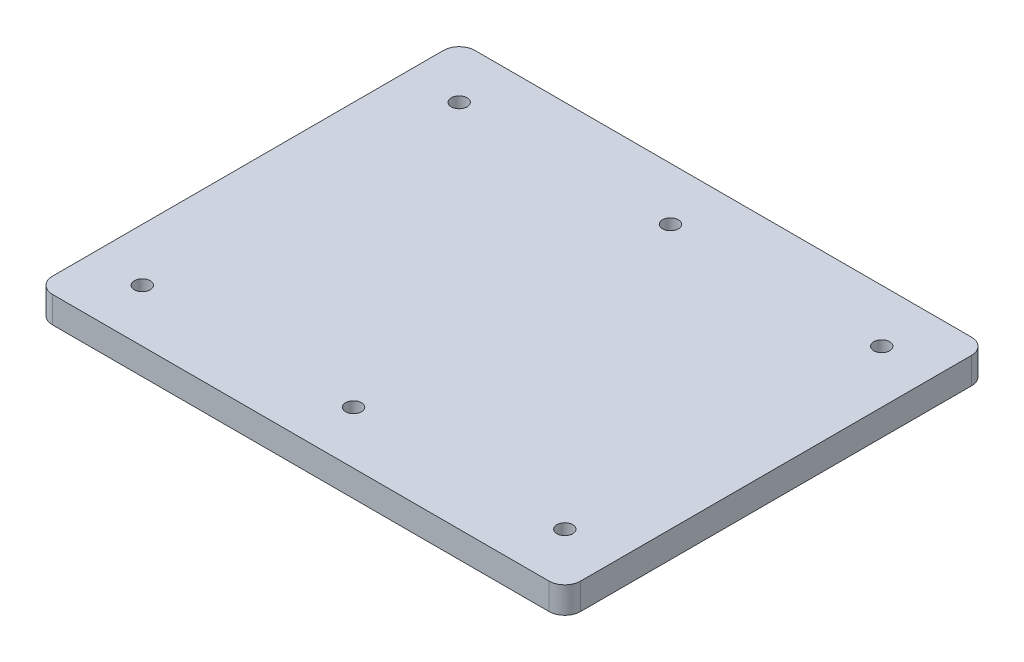
ISO-10303-21;
HEADER;
FILE_DESCRIPTION(('STEP AP214'),'2;1');
FILE_NAME('part.step','',(''),(''),'','','');
FILE_SCHEMA(('AUTOMOTIVE_DESIGN { 1 0 10303 214 1 1 1 1 }'));
ENDSEC;
DATA;
#1=APPLICATION_CONTEXT('core data for automotive mechanical design processes');
#2=APPLICATION_PROTOCOL_DEFINITION('international standard','automotive_design',2000,#1);
#3=PRODUCT_CONTEXT('',#1,'mechanical');
#4=PRODUCT('Part','Part','',(#3));
#5=PRODUCT_RELATED_PRODUCT_CATEGORY('part','',(#4));
#6=PRODUCT_DEFINITION_FORMATION('','',#4);
#7=PRODUCT_DEFINITION_CONTEXT('part definition',#1,'design');
#8=PRODUCT_DEFINITION('design','',#6,#7);
#9=PRODUCT_DEFINITION_SHAPE('','',#8);
#10=(LENGTH_UNIT() NAMED_UNIT(*) SI_UNIT(.MILLI.,.METRE.));
#11=(NAMED_UNIT(*) PLANE_ANGLE_UNIT() SI_UNIT($,.RADIAN.));
#12=(NAMED_UNIT(*) SI_UNIT($,.STERADIAN.) SOLID_ANGLE_UNIT());
#13=UNCERTAINTY_MEASURE_WITH_UNIT(LENGTH_MEASURE(1.E-05),#10,'distance_accuracy_value','');
#14=(GEOMETRIC_REPRESENTATION_CONTEXT(3) GLOBAL_UNCERTAINTY_ASSIGNED_CONTEXT((#13)) GLOBAL_UNIT_ASSIGNED_CONTEXT((#10,
#11,#12)) REPRESENTATION_CONTEXT('',''));
#15=CARTESIAN_POINT('',(0.,0.,0.));
#16=DIRECTION('',(0.,0.,1.));
#17=DIRECTION('',(1.,0.,0.));
#18=AXIS2_PLACEMENT_3D('',#15,#16,#17);
#19=CARTESIAN_POINT('',(0.,5.,0.));
#20=DIRECTION('',(0.,-1.,0.));
#21=DIRECTION('',(0.,0.,-1.));
#22=AXIS2_PLACEMENT_3D('',#19,#20,#21);
#23=PLANE('',#22);
#24=CARTESIAN_POINT('',(50.,5.,-70.));
#25=DIRECTION('',(0.,1.,0.));
#26=DIRECTION('',(0.,0.,-1.));
#27=AXIS2_PLACEMENT_3D('',#24,#25,#26);
#28=CIRCLE('',#27,1.5);
#29=CARTESIAN_POINT('',(50.,5.,-71.5));
#30=VERTEX_POINT('',#29);
#31=EDGE_CURVE('E200',#30,#30,#28,.T.);
#32=ORIENTED_EDGE('',*,*,#31,.F.);
#33=EDGE_LOOP('',(#32));
#34=FACE_BOUND('',#33,.T.);
#35=CARTESIAN_POINT('',(50.,5.,-10.));
#36=DIRECTION('',(0.,1.,0.));
#37=DIRECTION('',(0.,0.,1.));
#38=AXIS2_PLACEMENT_3D('',#35,#36,#37);
#39=CIRCLE('',#38,1.5);
#40=CARTESIAN_POINT('',(50.,5.,-8.5));
#41=VERTEX_POINT('',#40);
#42=EDGE_CURVE('E188',#41,#41,#39,.T.);
#43=ORIENTED_EDGE('',*,*,#42,.F.);
#44=EDGE_LOOP('',(#43));
#45=FACE_BOUND('',#44,.T.);
#46=CARTESIAN_POINT('',(10.,5.,-10.));
#47=DIRECTION('',(0.,1.,0.));
#48=DIRECTION('',(0.,0.,1.));
#49=AXIS2_PLACEMENT_3D('',#46,#47,#48);
#50=CIRCLE('',#49,1.5);
#51=CARTESIAN_POINT('',(10.,5.,-8.5));
#52=VERTEX_POINT('',#51);
#53=EDGE_CURVE('E129',#52,#52,#50,.T.);
#54=ORIENTED_EDGE('',*,*,#53,.F.);
#55=EDGE_LOOP('',(#54));
#56=FACE_BOUND('',#55,.T.);
#57=DIRECTION('',(-1.,0.,0.));
#58=VECTOR('',#57,1.);
#59=CARTESIAN_POINT('',(0.,5.,-80.));
#60=LINE('',#59,#58);
#61=CARTESIAN_POINT('',(97.,5.,-80.));
#62=VERTEX_POINT('',#61);
#63=CARTESIAN_POINT('',(3.,5.,-80.));
#64=VERTEX_POINT('',#63);
#65=EDGE_CURVE('E138',#62,#64,#60,.T.);
#66=ORIENTED_EDGE('',*,*,#65,.T.);
#67=CARTESIAN_POINT('',(3.,5.,-77.));
#68=DIRECTION('',(0.,-1.,0.));
#69=DIRECTION('',(0.,0.,-1.));
#70=AXIS2_PLACEMENT_3D('',#67,#68,#69);
#71=CIRCLE('',#70,3.);
#72=CARTESIAN_POINT('',(0.,5.,-77.));
#73=VERTEX_POINT('',#72);
#74=EDGE_CURVE('E157',#64,#73,#71,.F.);
#75=ORIENTED_EDGE('',*,*,#74,.T.);
#76=DIRECTION('',(0.,0.,1.));
#77=VECTOR('',#76,1.);
#78=CARTESIAN_POINT('',(0.,5.,0.));
#79=LINE('',#78,#77);
#80=CARTESIAN_POINT('',(0.,5.,-3.));
#81=VERTEX_POINT('',#80);
#82=EDGE_CURVE('E121',#73,#81,#79,.T.);
#83=ORIENTED_EDGE('',*,*,#82,.T.);
#84=CARTESIAN_POINT('',(3.,5.,-3.));
#85=DIRECTION('',(0.,-1.,0.));
#86=DIRECTION('',(0.,0.,-1.));
#87=AXIS2_PLACEMENT_3D('',#84,#85,#86);
#88=CIRCLE('',#87,3.);
#89=CARTESIAN_POINT('',(3.,5.,0.));
#90=VERTEX_POINT('',#89);
#91=EDGE_CURVE('E152',#81,#90,#88,.F.);
#92=ORIENTED_EDGE('',*,*,#91,.T.);
#93=DIRECTION('',(1.,0.,0.));
#94=VECTOR('',#93,1.);
#95=CARTESIAN_POINT('',(0.,5.,0.));
#96=LINE('',#95,#94);
#97=CARTESIAN_POINT('',(97.,5.,0.));
#98=VERTEX_POINT('',#97);
#99=EDGE_CURVE('E168',#90,#98,#96,.T.);
#100=ORIENTED_EDGE('',*,*,#99,.T.);
#101=CARTESIAN_POINT('',(97.,5.,-3.));
#102=DIRECTION('',(0.,-1.,0.));
#103=DIRECTION('',(0.,0.,-1.));
#104=AXIS2_PLACEMENT_3D('',#101,#102,#103);
#105=CIRCLE('',#104,3.);
#106=CARTESIAN_POINT('',(100.,5.,-3.));
#107=VERTEX_POINT('',#106);
#108=EDGE_CURVE('E57',#98,#107,#105,.F.);
#109=ORIENTED_EDGE('',*,*,#108,.T.);
#110=DIRECTION('',(0.,0.,-1.));
#111=VECTOR('',#110,1.);
#112=CARTESIAN_POINT('',(100.,5.,0.));
#113=LINE('',#112,#111);
#114=CARTESIAN_POINT('',(100.,5.,-77.));
#115=VERTEX_POINT('',#114);
#116=EDGE_CURVE('E176',#107,#115,#113,.T.);
#117=ORIENTED_EDGE('',*,*,#116,.T.);
#118=CARTESIAN_POINT('',(97.,5.,-77.));
#119=DIRECTION('',(0.,-1.,0.));
#120=DIRECTION('',(0.,0.,-1.));
#121=AXIS2_PLACEMENT_3D('',#118,#119,#120);
#122=CIRCLE('',#121,3.);
#123=EDGE_CURVE('E155',#115,#62,#122,.F.);
#124=ORIENTED_EDGE('',*,*,#123,.T.);
#125=EDGE_LOOP('',(#66,#75,#83,#92,#100,#109,#117,#124));
#126=FACE_BOUND('',#125,.T.);
#127=CARTESIAN_POINT('',(90.,5.,-70.));
#128=DIRECTION('',(0.,1.,0.));
#129=DIRECTION('',(0.,0.,-1.));
#130=AXIS2_PLACEMENT_3D('',#127,#128,#129);
#131=CIRCLE('',#130,1.5);
#132=CARTESIAN_POINT('',(90.,5.,-71.5));
#133=VERTEX_POINT('',#132);
#134=EDGE_CURVE('E183',#133,#133,#131,.T.);
#135=ORIENTED_EDGE('',*,*,#134,.F.);
#136=EDGE_LOOP('',(#135));
#137=FACE_BOUND('',#136,.T.);
#138=CARTESIAN_POINT('',(90.,5.,-10.));
#139=DIRECTION('',(0.,1.,0.));
#140=DIRECTION('',(0.,0.,1.));
#141=AXIS2_PLACEMENT_3D('',#138,#139,#140);
#142=CIRCLE('',#141,1.5);
#143=CARTESIAN_POINT('',(90.,5.,-8.5));
#144=VERTEX_POINT('',#143);
#145=EDGE_CURVE('E194',#144,#144,#142,.T.);
#146=ORIENTED_EDGE('',*,*,#145,.F.);
#147=EDGE_LOOP('',(#146));
#148=FACE_BOUND('',#147,.T.);
#149=CARTESIAN_POINT('',(10.,5.,-70.));
#150=DIRECTION('',(0.,1.,0.));
#151=DIRECTION('',(0.,0.,-1.));
#152=AXIS2_PLACEMENT_3D('',#149,#150,#151);
#153=CIRCLE('',#152,1.5);
#154=CARTESIAN_POINT('',(10.,5.,-71.5));
#155=VERTEX_POINT('',#154);
#156=EDGE_CURVE('E206',#155,#155,#153,.T.);
#157=ORIENTED_EDGE('',*,*,#156,.F.);
#158=EDGE_LOOP('',(#157));
#159=FACE_BOUND('',#158,.T.);
#160=ADVANCED_FACE('F35',(#34,#45,#56,#126,#137,#148,#159),#23,.F.);
#161=CARTESIAN_POINT('',(0.,0.,0.));
#162=DIRECTION('',(0.,-1.,0.));
#163=DIRECTION('',(0.,0.,-1.));
#164=AXIS2_PLACEMENT_3D('',#161,#162,#163);
#165=PLANE('',#164);
#166=CARTESIAN_POINT('',(50.,0.,-70.));
#167=DIRECTION('',(0.,1.,0.));
#168=DIRECTION('',(0.,0.,-1.));
#169=AXIS2_PLACEMENT_3D('',#166,#167,#168);
#170=CIRCLE('',#169,1.5);
#171=CARTESIAN_POINT('',(50.,0.,-71.5));
#172=VERTEX_POINT('',#171);
#173=EDGE_CURVE('E203',#172,#172,#170,.T.);
#174=ORIENTED_EDGE('',*,*,#173,.T.);
#175=EDGE_LOOP('',(#174));
#176=FACE_BOUND('',#175,.T.);
#177=CARTESIAN_POINT('',(50.,0.,-10.));
#178=DIRECTION('',(0.,1.,0.));
#179=DIRECTION('',(0.,0.,1.));
#180=AXIS2_PLACEMENT_3D('',#177,#178,#179);
#181=CIRCLE('',#180,1.5);
#182=CARTESIAN_POINT('',(50.,0.,-8.5));
#183=VERTEX_POINT('',#182);
#184=EDGE_CURVE('E191',#183,#183,#181,.T.);
#185=ORIENTED_EDGE('',*,*,#184,.T.);
#186=EDGE_LOOP('',(#185));
#187=FACE_BOUND('',#186,.T.);
#188=CARTESIAN_POINT('',(10.,0.,-10.));
#189=DIRECTION('',(0.,1.,0.));
#190=DIRECTION('',(0.,0.,1.));
#191=AXIS2_PLACEMENT_3D('',#188,#189,#190);
#192=CIRCLE('',#191,1.5);
#193=CARTESIAN_POINT('',(10.,0.,-8.5));
#194=VERTEX_POINT('',#193);
#195=EDGE_CURVE('E135',#194,#194,#192,.T.);
#196=ORIENTED_EDGE('',*,*,#195,.T.);
#197=EDGE_LOOP('',(#196));
#198=FACE_BOUND('',#197,.T.);
#199=DIRECTION('',(0.,0.,1.));
#200=VECTOR('',#199,1.);
#201=CARTESIAN_POINT('',(0.,0.,0.));
#202=LINE('',#201,#200);
#203=CARTESIAN_POINT('',(0.,0.,-77.));
#204=VERTEX_POINT('',#203);
#205=CARTESIAN_POINT('',(0.,0.,-3.));
#206=VERTEX_POINT('',#205);
#207=EDGE_CURVE('E118',#204,#206,#202,.T.);
#208=ORIENTED_EDGE('',*,*,#207,.F.);
#209=CARTESIAN_POINT('',(3.,0.,-77.));
#210=DIRECTION('',(0.,-1.,0.));
#211=DIRECTION('',(0.,0.,-1.));
#212=AXIS2_PLACEMENT_3D('',#209,#210,#211);
#213=CIRCLE('',#212,3.);
#214=CARTESIAN_POINT('',(3.,0.,-80.));
#215=VERTEX_POINT('',#214);
#216=EDGE_CURVE('E101',#204,#215,#213,.T.);
#217=ORIENTED_EDGE('',*,*,#216,.T.);
#218=DIRECTION('',(-1.,0.,0.));
#219=VECTOR('',#218,1.);
#220=CARTESIAN_POINT('',(0.,0.,-80.));
#221=LINE('',#220,#219);
#222=CARTESIAN_POINT('',(97.,0.,-80.));
#223=VERTEX_POINT('',#222);
#224=EDGE_CURVE('E142',#223,#215,#221,.T.);
#225=ORIENTED_EDGE('',*,*,#224,.F.);
#226=CARTESIAN_POINT('',(97.,0.,-77.));
#227=DIRECTION('',(0.,-1.,0.));
#228=DIRECTION('',(0.,0.,-1.));
#229=AXIS2_PLACEMENT_3D('',#226,#227,#228);
#230=CIRCLE('',#229,3.);
#231=CARTESIAN_POINT('',(100.,0.,-77.));
#232=VERTEX_POINT('',#231);
#233=EDGE_CURVE('E112',#223,#232,#230,.T.);
#234=ORIENTED_EDGE('',*,*,#233,.T.);
#235=DIRECTION('',(0.,0.,-1.));
#236=VECTOR('',#235,1.);
#237=CARTESIAN_POINT('',(100.,0.,0.));
#238=LINE('',#237,#236);
#239=CARTESIAN_POINT('',(100.,0.,-3.));
#240=VERTEX_POINT('',#239);
#241=EDGE_CURVE('E132',#240,#232,#238,.T.);
#242=ORIENTED_EDGE('',*,*,#241,.F.);
#243=CARTESIAN_POINT('',(97.,0.,-3.));
#244=DIRECTION('',(0.,-1.,0.));
#245=DIRECTION('',(0.,0.,-1.));
#246=AXIS2_PLACEMENT_3D('',#243,#244,#245);
#247=CIRCLE('',#246,3.);
#248=CARTESIAN_POINT('',(97.,0.,0.));
#249=VERTEX_POINT('',#248);
#250=EDGE_CURVE('E146',#240,#249,#247,.T.);
#251=ORIENTED_EDGE('',*,*,#250,.T.);
#252=DIRECTION('',(1.,0.,0.));
#253=VECTOR('',#252,1.);
#254=CARTESIAN_POINT('',(0.,0.,0.));
#255=LINE('',#254,#253);
#256=CARTESIAN_POINT('',(3.,0.,0.));
#257=VERTEX_POINT('',#256);
#258=EDGE_CURVE('E128',#257,#249,#255,.T.);
#259=ORIENTED_EDGE('',*,*,#258,.F.);
#260=CARTESIAN_POINT('',(3.,0.,-3.));
#261=DIRECTION('',(0.,-1.,0.));
#262=DIRECTION('',(0.,0.,-1.));
#263=AXIS2_PLACEMENT_3D('',#260,#261,#262);
#264=CIRCLE('',#263,3.);
#265=EDGE_CURVE('E122',#257,#206,#264,.T.);
#266=ORIENTED_EDGE('',*,*,#265,.T.);
#267=EDGE_LOOP('',(#208,#217,#225,#234,#242,#251,#259,#266));
#268=FACE_BOUND('',#267,.T.);
#269=CARTESIAN_POINT('',(90.,0.,-70.));
#270=DIRECTION('',(0.,1.,0.));
#271=DIRECTION('',(0.,0.,-1.));
#272=AXIS2_PLACEMENT_3D('',#269,#270,#271);
#273=CIRCLE('',#272,1.5);
#274=CARTESIAN_POINT('',(90.,0.,-71.5));
#275=VERTEX_POINT('',#274);
#276=EDGE_CURVE('E185',#275,#275,#273,.T.);
#277=ORIENTED_EDGE('',*,*,#276,.T.);
#278=EDGE_LOOP('',(#277));
#279=FACE_BOUND('',#278,.T.);
#280=CARTESIAN_POINT('',(90.,0.,-10.));
#281=DIRECTION('',(0.,1.,0.));
#282=DIRECTION('',(0.,0.,1.));
#283=AXIS2_PLACEMENT_3D('',#280,#281,#282);
#284=CIRCLE('',#283,1.5);
#285=CARTESIAN_POINT('',(90.,0.,-8.5));
#286=VERTEX_POINT('',#285);
#287=EDGE_CURVE('E197',#286,#286,#284,.T.);
#288=ORIENTED_EDGE('',*,*,#287,.T.);
#289=EDGE_LOOP('',(#288));
#290=FACE_BOUND('',#289,.T.);
#291=CARTESIAN_POINT('',(10.,0.,-70.));
#292=DIRECTION('',(0.,1.,0.));
#293=DIRECTION('',(0.,0.,-1.));
#294=AXIS2_PLACEMENT_3D('',#291,#292,#293);
#295=CIRCLE('',#294,1.5);
#296=CARTESIAN_POINT('',(10.,0.,-71.5));
#297=VERTEX_POINT('',#296);
#298=EDGE_CURVE('E209',#297,#297,#295,.T.);
#299=ORIENTED_EDGE('',*,*,#298,.T.);
#300=EDGE_LOOP('',(#299));
#301=FACE_BOUND('',#300,.T.);
#302=ADVANCED_FACE('F125',(#176,#187,#198,#268,#279,#290,#301),#165,.T.);
#303=CARTESIAN_POINT('',(0.,5.,0.));
#304=DIRECTION('',(1.,0.,0.));
#305=DIRECTION('',(0.,0.,-1.));
#306=AXIS2_PLACEMENT_3D('',#303,#304,#305);
#307=PLANE('',#306);
#308=ORIENTED_EDGE('',*,*,#82,.F.);
#309=DIRECTION('',(0.,-1.,0.));
#310=VECTOR('',#309,1.);
#311=CARTESIAN_POINT('',(0.,5.,-77.));
#312=LINE('',#311,#310);
#313=EDGE_CURVE('E105',#73,#204,#312,.T.);
#314=ORIENTED_EDGE('',*,*,#313,.T.);
#315=ORIENTED_EDGE('',*,*,#207,.T.);
#316=DIRECTION('',(0.,-1.,0.));
#317=VECTOR('',#316,1.);
#318=CARTESIAN_POINT('',(0.,5.,-3.));
#319=LINE('',#318,#317);
#320=EDGE_CURVE('E123',#206,#81,#319,.F.);
#321=ORIENTED_EDGE('',*,*,#320,.T.);
#322=EDGE_LOOP('',(#308,#314,#315,#321));
#323=FACE_BOUND('',#322,.T.);
#324=ADVANCED_FACE('F117',(#323),#307,.F.);
#325=CARTESIAN_POINT('',(0.,5.,0.));
#326=DIRECTION('',(0.,0.,-1.));
#327=DIRECTION('',(-1.,0.,0.));
#328=AXIS2_PLACEMENT_3D('',#325,#326,#327);
#329=PLANE('',#328);
#330=ORIENTED_EDGE('',*,*,#258,.T.);
#331=DIRECTION('',(0.,-1.,0.));
#332=VECTOR('',#331,1.);
#333=CARTESIAN_POINT('',(97.,5.,0.));
#334=LINE('',#333,#332);
#335=EDGE_CURVE('E11',#249,#98,#334,.F.);
#336=ORIENTED_EDGE('',*,*,#335,.T.);
#337=ORIENTED_EDGE('',*,*,#99,.F.);
#338=DIRECTION('',(0.,-1.,0.));
#339=VECTOR('',#338,1.);
#340=CARTESIAN_POINT('',(3.,5.,0.));
#341=LINE('',#340,#339);
#342=EDGE_CURVE('E43',#90,#257,#341,.T.);
#343=ORIENTED_EDGE('',*,*,#342,.T.);
#344=EDGE_LOOP('',(#330,#336,#337,#343));
#345=FACE_BOUND('',#344,.T.);
#346=ADVANCED_FACE('F166',(#345),#329,.F.);
#347=CARTESIAN_POINT('',(100.,5.,0.));
#348=DIRECTION('',(-1.,0.,0.));
#349=DIRECTION('',(0.,0.,1.));
#350=AXIS2_PLACEMENT_3D('',#347,#348,#349);
#351=PLANE('',#350);
#352=ORIENTED_EDGE('',*,*,#241,.T.);
#353=DIRECTION('',(0.,-1.,0.));
#354=VECTOR('',#353,1.);
#355=CARTESIAN_POINT('',(100.,5.,-77.));
#356=LINE('',#355,#354);
#357=EDGE_CURVE('E50',#232,#115,#356,.F.);
#358=ORIENTED_EDGE('',*,*,#357,.T.);
#359=ORIENTED_EDGE('',*,*,#116,.F.);
#360=DIRECTION('',(0.,-1.,0.));
#361=VECTOR('',#360,1.);
#362=CARTESIAN_POINT('',(100.,5.,-3.));
#363=LINE('',#362,#361);
#364=EDGE_CURVE('E159',#107,#240,#363,.T.);
#365=ORIENTED_EDGE('',*,*,#364,.T.);
#366=EDGE_LOOP('',(#352,#358,#359,#365));
#367=FACE_BOUND('',#366,.T.);
#368=ADVANCED_FACE('F175',(#367),#351,.F.);
#369=CARTESIAN_POINT('',(0.,5.,-80.));
#370=DIRECTION('',(0.,0.,1.));
#371=DIRECTION('',(1.,0.,0.));
#372=AXIS2_PLACEMENT_3D('',#369,#370,#371);
#373=PLANE('',#372);
#374=ORIENTED_EDGE('',*,*,#224,.T.);
#375=DIRECTION('',(0.,-1.,0.));
#376=VECTOR('',#375,1.);
#377=CARTESIAN_POINT('',(3.,5.,-80.));
#378=LINE('',#377,#376);
#379=EDGE_CURVE('E106',#215,#64,#378,.F.);
#380=ORIENTED_EDGE('',*,*,#379,.T.);
#381=ORIENTED_EDGE('',*,*,#65,.F.);
#382=DIRECTION('',(0.,-1.,0.));
#383=VECTOR('',#382,1.);
#384=CARTESIAN_POINT('',(97.,5.,-80.));
#385=LINE('',#384,#383);
#386=EDGE_CURVE('E111',#62,#223,#385,.T.);
#387=ORIENTED_EDGE('',*,*,#386,.T.);
#388=EDGE_LOOP('',(#374,#380,#381,#387));
#389=FACE_BOUND('',#388,.T.);
#390=ADVANCED_FACE('F232',(#389),#373,.F.);
#391=CARTESIAN_POINT('',(10.,5.,-10.));
#392=DIRECTION('',(0.,-1.,0.));
#393=DIRECTION('',(0.,0.,-1.));
#394=AXIS2_PLACEMENT_3D('',#391,#392,#393);
#395=CYLINDRICAL_SURFACE('',#394,1.5);
#396=ORIENTED_EDGE('',*,*,#53,.T.);
#397=EDGE_LOOP('',(#396));
#398=FACE_BOUND('',#397,.T.);
#399=ORIENTED_EDGE('',*,*,#195,.F.);
#400=EDGE_LOOP('',(#399));
#401=FACE_BOUND('',#400,.T.);
#402=ADVANCED_FACE('F229',(#398,#401),#395,.F.);
#403=CARTESIAN_POINT('',(90.,5.,-70.));
#404=DIRECTION('',(0.,-1.,0.));
#405=DIRECTION('',(0.,0.,-1.));
#406=AXIS2_PLACEMENT_3D('',#403,#404,#405);
#407=CYLINDRICAL_SURFACE('',#406,1.5);
#408=ORIENTED_EDGE('',*,*,#134,.T.);
#409=EDGE_LOOP('',(#408));
#410=FACE_BOUND('',#409,.T.);
#411=ORIENTED_EDGE('',*,*,#276,.F.);
#412=EDGE_LOOP('',(#411));
#413=FACE_BOUND('',#412,.T.);
#414=ADVANCED_FACE('F279',(#410,#413),#407,.F.);
#415=CARTESIAN_POINT('',(50.,5.,-10.));
#416=DIRECTION('',(0.,-1.,0.));
#417=DIRECTION('',(0.,0.,-1.));
#418=AXIS2_PLACEMENT_3D('',#415,#416,#417);
#419=CYLINDRICAL_SURFACE('',#418,1.5);
#420=ORIENTED_EDGE('',*,*,#42,.T.);
#421=EDGE_LOOP('',(#420));
#422=FACE_BOUND('',#421,.T.);
#423=ORIENTED_EDGE('',*,*,#184,.F.);
#424=EDGE_LOOP('',(#423));
#425=FACE_BOUND('',#424,.T.);
#426=ADVANCED_FACE('F264',(#422,#425),#419,.F.);
#427=CARTESIAN_POINT('',(90.,5.,-10.));
#428=DIRECTION('',(0.,-1.,0.));
#429=DIRECTION('',(0.,0.,-1.));
#430=AXIS2_PLACEMENT_3D('',#427,#428,#429);
#431=CYLINDRICAL_SURFACE('',#430,1.5);
#432=ORIENTED_EDGE('',*,*,#145,.T.);
#433=EDGE_LOOP('',(#432));
#434=FACE_BOUND('',#433,.T.);
#435=ORIENTED_EDGE('',*,*,#287,.F.);
#436=EDGE_LOOP('',(#435));
#437=FACE_BOUND('',#436,.T.);
#438=ADVANCED_FACE('F260',(#434,#437),#431,.F.);
#439=CARTESIAN_POINT('',(50.,5.,-70.));
#440=DIRECTION('',(0.,-1.,0.));
#441=DIRECTION('',(0.,0.,-1.));
#442=AXIS2_PLACEMENT_3D('',#439,#440,#441);
#443=CYLINDRICAL_SURFACE('',#442,1.5);
#444=ORIENTED_EDGE('',*,*,#31,.T.);
#445=EDGE_LOOP('',(#444));
#446=FACE_BOUND('',#445,.T.);
#447=ORIENTED_EDGE('',*,*,#173,.F.);
#448=EDGE_LOOP('',(#447));
#449=FACE_BOUND('',#448,.T.);
#450=ADVANCED_FACE('F263',(#446,#449),#443,.F.);
#451=CARTESIAN_POINT('',(10.,5.,-70.));
#452=DIRECTION('',(0.,-1.,0.));
#453=DIRECTION('',(0.,0.,-1.));
#454=AXIS2_PLACEMENT_3D('',#451,#452,#453);
#455=CYLINDRICAL_SURFACE('',#454,1.5);
#456=ORIENTED_EDGE('',*,*,#156,.T.);
#457=EDGE_LOOP('',(#456));
#458=FACE_BOUND('',#457,.T.);
#459=ORIENTED_EDGE('',*,*,#298,.F.);
#460=EDGE_LOOP('',(#459));
#461=FACE_BOUND('',#460,.T.);
#462=ADVANCED_FACE('F215',(#458,#461),#455,.F.);
#463=CARTESIAN_POINT('',(3.,5.,-77.));
#464=DIRECTION('',(0.,-1.,0.));
#465=DIRECTION('',(0.,0.,-1.));
#466=AXIS2_PLACEMENT_3D('',#463,#464,#465);
#467=CYLINDRICAL_SURFACE('',#466,3.);
#468=ORIENTED_EDGE('',*,*,#74,.F.);
#469=ORIENTED_EDGE('',*,*,#379,.F.);
#470=ORIENTED_EDGE('',*,*,#216,.F.);
#471=ORIENTED_EDGE('',*,*,#313,.F.);
#472=EDGE_LOOP('',(#468,#469,#470,#471));
#473=FACE_BOUND('',#472,.T.);
#474=ADVANCED_FACE('F104',(#473),#467,.T.);
#475=CARTESIAN_POINT('',(97.,5.,-77.));
#476=DIRECTION('',(0.,-1.,0.));
#477=DIRECTION('',(0.,0.,-1.));
#478=AXIS2_PLACEMENT_3D('',#475,#476,#477);
#479=CYLINDRICAL_SURFACE('',#478,3.);
#480=ORIENTED_EDGE('',*,*,#123,.F.);
#481=ORIENTED_EDGE('',*,*,#357,.F.);
#482=ORIENTED_EDGE('',*,*,#233,.F.);
#483=ORIENTED_EDGE('',*,*,#386,.F.);
#484=EDGE_LOOP('',(#480,#481,#482,#483));
#485=FACE_BOUND('',#484,.T.);
#486=ADVANCED_FACE('F244',(#485),#479,.T.);
#487=CARTESIAN_POINT('',(97.,5.,-3.));
#488=DIRECTION('',(0.,-1.,0.));
#489=DIRECTION('',(0.,0.,-1.));
#490=AXIS2_PLACEMENT_3D('',#487,#488,#489);
#491=CYLINDRICAL_SURFACE('',#490,3.);
#492=ORIENTED_EDGE('',*,*,#108,.F.);
#493=ORIENTED_EDGE('',*,*,#335,.F.);
#494=ORIENTED_EDGE('',*,*,#250,.F.);
#495=ORIENTED_EDGE('',*,*,#364,.F.);
#496=EDGE_LOOP('',(#492,#493,#494,#495));
#497=FACE_BOUND('',#496,.T.);
#498=ADVANCED_FACE('F174',(#497),#491,.T.);
#499=CARTESIAN_POINT('',(3.,5.,-3.));
#500=DIRECTION('',(0.,-1.,0.));
#501=DIRECTION('',(0.,0.,-1.));
#502=AXIS2_PLACEMENT_3D('',#499,#500,#501);
#503=CYLINDRICAL_SURFACE('',#502,3.);
#504=ORIENTED_EDGE('',*,*,#91,.F.);
#505=ORIENTED_EDGE('',*,*,#320,.F.);
#506=ORIENTED_EDGE('',*,*,#265,.F.);
#507=ORIENTED_EDGE('',*,*,#342,.F.);
#508=EDGE_LOOP('',(#504,#505,#506,#507));
#509=FACE_BOUND('',#508,.T.);
#510=ADVANCED_FACE('F37',(#509),#503,.T.);
#511=CLOSED_SHELL('',(#160,#302,#324,#346,#368,#390,#402,#414,#426,#438,#450,#462,#474,#486,
#498,#510));
#512=MANIFOLD_SOLID_BREP('B2',#511);
#513=ADVANCED_BREP_SHAPE_REPRESENTATION('',(#18,#512),#14);
#514=SHAPE_DEFINITION_REPRESENTATION(#9,#513);
ENDSEC;
END-ISO-10303-21;
